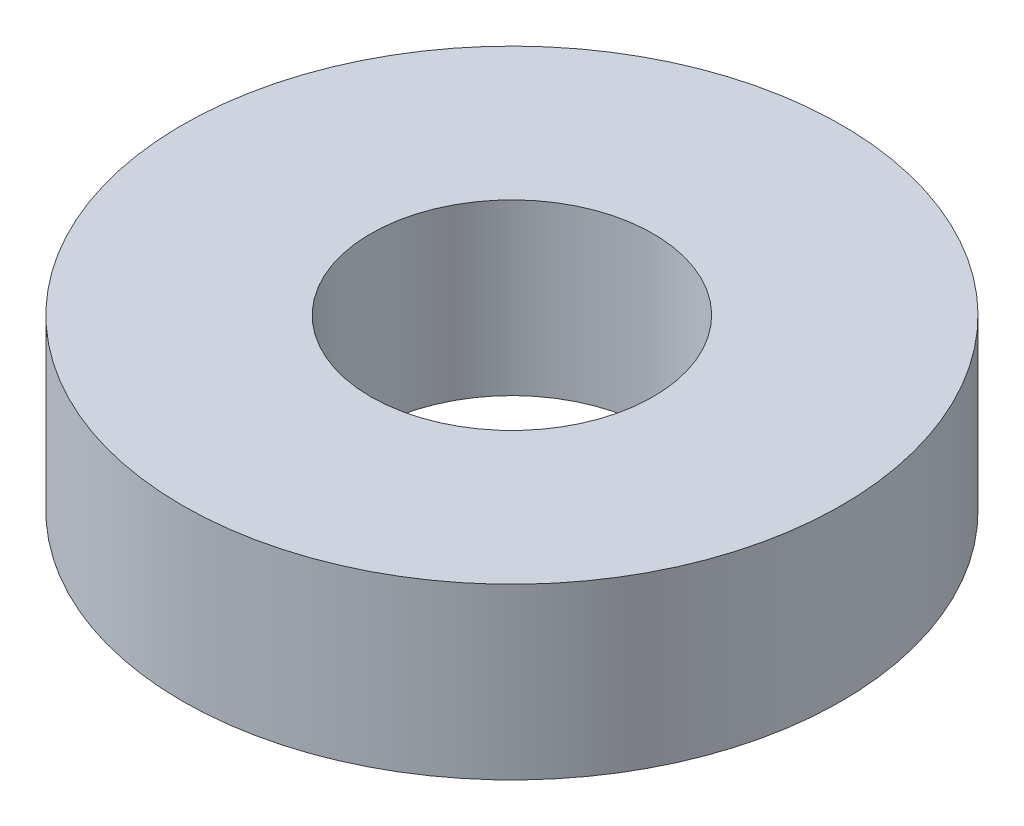
ISO-10303-21;
HEADER;
FILE_DESCRIPTION(('STEP AP214'),'2;1');
FILE_NAME('part.step','',(''),(''),'','','');
FILE_SCHEMA(('AUTOMOTIVE_DESIGN { 1 0 10303 214 1 1 1 1 }'));
ENDSEC;
DATA;
#1=APPLICATION_CONTEXT('core data for automotive mechanical design processes');
#2=APPLICATION_PROTOCOL_DEFINITION('international standard','automotive_design',2000,#1);
#3=PRODUCT_CONTEXT('',#1,'mechanical');
#4=PRODUCT('Part','Part','',(#3));
#5=PRODUCT_RELATED_PRODUCT_CATEGORY('part','',(#4));
#6=PRODUCT_DEFINITION_FORMATION('','',#4);
#7=PRODUCT_DEFINITION_CONTEXT('part definition',#1,'design');
#8=PRODUCT_DEFINITION('design','',#6,#7);
#9=PRODUCT_DEFINITION_SHAPE('','',#8);
#10=(LENGTH_UNIT() NAMED_UNIT(*) SI_UNIT(.MILLI.,.METRE.));
#11=(NAMED_UNIT(*) PLANE_ANGLE_UNIT() SI_UNIT($,.RADIAN.));
#12=(NAMED_UNIT(*) SI_UNIT($,.STERADIAN.) SOLID_ANGLE_UNIT());
#13=UNCERTAINTY_MEASURE_WITH_UNIT(LENGTH_MEASURE(1.E-05),#10,'distance_accuracy_value','');
#14=(GEOMETRIC_REPRESENTATION_CONTEXT(3) GLOBAL_UNCERTAINTY_ASSIGNED_CONTEXT((#13)) GLOBAL_UNIT_ASSIGNED_CONTEXT((#10,
#11,#12)) REPRESENTATION_CONTEXT('',''));
#15=CARTESIAN_POINT('',(0.,0.,0.));
#16=DIRECTION('',(0.,0.,1.));
#17=DIRECTION('',(1.,0.,0.));
#18=AXIS2_PLACEMENT_3D('',#15,#16,#17);
#19=CARTESIAN_POINT('',(0.,18.,0.));
#20=DIRECTION('',(0.,-1.,0.));
#21=DIRECTION('',(0.,0.,-1.));
#22=AXIS2_PLACEMENT_3D('',#19,#20,#21);
#23=CYLINDRICAL_SURFACE('',#22,35.);
#24=CARTESIAN_POINT('',(0.,18.,0.));
#25=DIRECTION('',(0.,1.,0.));
#26=DIRECTION('',(0.,0.,1.));
#27=AXIS2_PLACEMENT_3D('',#24,#25,#26);
#28=CIRCLE('',#27,35.);
#29=CARTESIAN_POINT('',(0.,18.,35.));
#30=VERTEX_POINT('',#29);
#31=EDGE_CURVE('E10',#30,#30,#28,.T.);
#32=ORIENTED_EDGE('',*,*,#31,.F.);
#33=EDGE_LOOP('',(#32));
#34=FACE_BOUND('',#33,.T.);
#35=CARTESIAN_POINT('',(0.,0.,0.));
#36=DIRECTION('',(0.,1.,0.));
#37=DIRECTION('',(0.,0.,1.));
#38=AXIS2_PLACEMENT_3D('',#35,#36,#37);
#39=CIRCLE('',#38,35.);
#40=CARTESIAN_POINT('',(0.,0.,35.));
#41=VERTEX_POINT('',#40);
#42=EDGE_CURVE('E37',#41,#41,#39,.T.);
#43=ORIENTED_EDGE('',*,*,#42,.T.);
#44=EDGE_LOOP('',(#43));
#45=FACE_BOUND('',#44,.T.);
#46=ADVANCED_FACE('F40',(#34,#45),#23,.T.);
#47=CARTESIAN_POINT('',(0.,18.,0.));
#48=DIRECTION('',(0.,1.,0.));
#49=DIRECTION('',(0.,0.,1.));
#50=AXIS2_PLACEMENT_3D('',#47,#48,#49);
#51=PLANE('',#50);
#52=CARTESIAN_POINT('',(0.,18.,0.));
#53=DIRECTION('',(0.,1.,0.));
#54=DIRECTION('',(0.,0.,1.));
#55=AXIS2_PLACEMENT_3D('',#52,#53,#54);
#56=CIRCLE('',#55,15.);
#57=CARTESIAN_POINT('',(0.,18.,15.));
#58=VERTEX_POINT('',#57);
#59=EDGE_CURVE('E50',#58,#58,#56,.T.);
#60=ORIENTED_EDGE('',*,*,#59,.F.);
#61=EDGE_LOOP('',(#60));
#62=FACE_BOUND('',#61,.T.);
#63=ORIENTED_EDGE('',*,*,#31,.T.);
#64=EDGE_LOOP('',(#63));
#65=FACE_BOUND('',#64,.T.);
#66=ADVANCED_FACE('F59',(#62,#65),#51,.T.);
#67=CARTESIAN_POINT('',(0.,0.,0.));
#68=DIRECTION('',(0.,1.,0.));
#69=DIRECTION('',(0.,0.,1.));
#70=AXIS2_PLACEMENT_3D('',#67,#68,#69);
#71=PLANE('',#70);
#72=CARTESIAN_POINT('',(0.,0.,0.));
#73=DIRECTION('',(0.,1.,0.));
#74=DIRECTION('',(0.,0.,1.));
#75=AXIS2_PLACEMENT_3D('',#72,#73,#74);
#76=CIRCLE('',#75,15.);
#77=CARTESIAN_POINT('',(0.,0.,15.));
#78=VERTEX_POINT('',#77);
#79=EDGE_CURVE('E47',#78,#78,#76,.T.);
#80=ORIENTED_EDGE('',*,*,#79,.T.);
#81=EDGE_LOOP('',(#80));
#82=FACE_BOUND('',#81,.T.);
#83=ORIENTED_EDGE('',*,*,#42,.F.);
#84=EDGE_LOOP('',(#83));
#85=FACE_BOUND('',#84,.T.);
#86=ADVANCED_FACE('F58',(#82,#85),#71,.F.);
#87=CARTESIAN_POINT('',(0.,18.,0.));
#88=DIRECTION('',(0.,-1.,0.));
#89=DIRECTION('',(0.,0.,-1.));
#90=AXIS2_PLACEMENT_3D('',#87,#88,#89);
#91=CYLINDRICAL_SURFACE('',#90,15.);
#92=ORIENTED_EDGE('',*,*,#59,.T.);
#93=EDGE_LOOP('',(#92));
#94=FACE_BOUND('',#93,.T.);
#95=ORIENTED_EDGE('',*,*,#79,.F.);
#96=EDGE_LOOP('',(#95));
#97=FACE_BOUND('',#96,.T.);
#98=ADVANCED_FACE('F54',(#94,#97),#91,.F.);
#99=CLOSED_SHELL('',(#46,#66,#86,#98));
#100=MANIFOLD_SOLID_BREP('B2',#99);
#101=ADVANCED_BREP_SHAPE_REPRESENTATION('',(#18,#100),#14);
#102=SHAPE_DEFINITION_REPRESENTATION(#9,#101);
ENDSEC;
END-ISO-10303-21;
